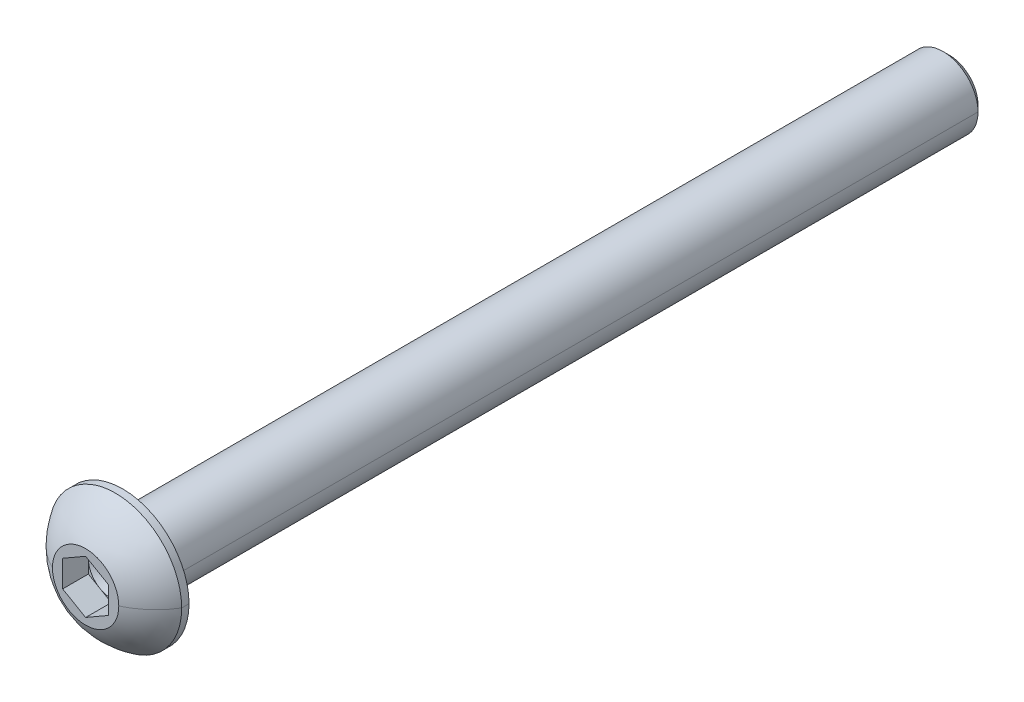
ISO-10303-21;
HEADER;
FILE_DESCRIPTION(('STEP AP214'),'2;1');
FILE_NAME('part.step','',(''),(''),'','','');
FILE_SCHEMA(('AUTOMOTIVE_DESIGN { 1 0 10303 214 1 1 1 1 }'));
ENDSEC;
DATA;
#1=APPLICATION_CONTEXT('core data for automotive mechanical design processes');
#2=APPLICATION_PROTOCOL_DEFINITION('international standard','automotive_design',2000,#1);
#3=PRODUCT_CONTEXT('',#1,'mechanical');
#4=PRODUCT('Part','Part','',(#3));
#5=PRODUCT_RELATED_PRODUCT_CATEGORY('part','',(#4));
#6=PRODUCT_DEFINITION_FORMATION('','',#4);
#7=PRODUCT_DEFINITION_CONTEXT('part definition',#1,'design');
#8=PRODUCT_DEFINITION('design','',#6,#7);
#9=PRODUCT_DEFINITION_SHAPE('','',#8);
#10=(LENGTH_UNIT() NAMED_UNIT(*) SI_UNIT(.MILLI.,.METRE.));
#11=(NAMED_UNIT(*) PLANE_ANGLE_UNIT() SI_UNIT($,.RADIAN.));
#12=(NAMED_UNIT(*) SI_UNIT($,.STERADIAN.) SOLID_ANGLE_UNIT());
#13=UNCERTAINTY_MEASURE_WITH_UNIT(LENGTH_MEASURE(1.E-05),#10,'distance_accuracy_value','');
#14=(GEOMETRIC_REPRESENTATION_CONTEXT(3) GLOBAL_UNCERTAINTY_ASSIGNED_CONTEXT((#13)) GLOBAL_UNIT_ASSIGNED_CONTEXT((#10,
#11,#12)) REPRESENTATION_CONTEXT('',''));
#15=CARTESIAN_POINT('',(0.,0.,0.));
#16=DIRECTION('',(0.,0.,1.));
#17=DIRECTION('',(1.,0.,0.));
#18=AXIS2_PLACEMENT_3D('',#15,#16,#17);
#19=CARTESIAN_POINT('',(0.,0.,-1.778));
#20=DIRECTION('',(0.,0.,1.));
#21=DIRECTION('',(1.,0.,0.));
#22=AXIS2_PLACEMENT_3D('',#19,#20,#21);
#23=PLANE('',#22);
#24=CARTESIAN_POINT('',(0.,0.,-1.778));
#25=DIRECTION('',(0.,0.,1.));
#26=DIRECTION('',(1.,0.,0.));
#27=AXIS2_PLACEMENT_3D('',#24,#25,#26);
#28=CIRCLE('',#27,1.5875);
#29=CARTESIAN_POINT('',(1.5875,0.,-1.778));
#30=VERTEX_POINT('',#29);
#31=CARTESIAN_POINT('',(0.79375,1.3748153285078,-1.778));
#32=VERTEX_POINT('',#31);
#33=EDGE_CURVE('E294',#30,#32,#28,.T.);
#34=ORIENTED_EDGE('',*,*,#33,.F.);
#35=DIRECTION('',(0.,-1.,0.));
#36=VECTOR('',#35,1.);
#37=CARTESIAN_POINT('',(1.5875,0.,-1.778));
#38=LINE('',#37,#36);
#39=CARTESIAN_POINT('',(1.5875,0.916543552338531,-1.778));
#40=VERTEX_POINT('',#39);
#41=EDGE_CURVE('E234',#40,#30,#38,.T.);
#42=ORIENTED_EDGE('',*,*,#41,.F.);
#43=DIRECTION('',(0.866025403784439,-0.5,0.));
#44=VECTOR('',#43,1.);
#45=CARTESIAN_POINT('',(0.79375,1.3748153285078,-1.778));
#46=LINE('',#45,#44);
#47=EDGE_CURVE('E376',#32,#40,#46,.T.);
#48=ORIENTED_EDGE('',*,*,#47,.F.);
#49=EDGE_LOOP('',(#34,#42,#48));
#50=FACE_BOUND('',#49,.T.);
#51=ADVANCED_FACE('F17',(#50),#23,.T.);
#52=CARTESIAN_POINT('',(0.,0.,-1.778));
#53=DIRECTION('',(0.,0.,1.));
#54=DIRECTION('',(1.,0.,0.));
#55=AXIS2_PLACEMENT_3D('',#52,#53,#54);
#56=PLANE('',#55);
#57=CARTESIAN_POINT('',(0.,0.,-1.778));
#58=DIRECTION('',(0.,0.,1.));
#59=DIRECTION('',(1.,0.,0.));
#60=AXIS2_PLACEMENT_3D('',#57,#58,#59);
#61=CIRCLE('',#60,1.5875);
#62=CARTESIAN_POINT('',(-0.79375,1.37481532850779,-1.778));
#63=VERTEX_POINT('',#62);
#64=EDGE_CURVE('E298',#32,#63,#61,.T.);
#65=ORIENTED_EDGE('',*,*,#64,.F.);
#66=DIRECTION('',(0.866025403784439,-0.5,0.));
#67=VECTOR('',#66,1.);
#68=CARTESIAN_POINT('',(0.79375,1.3748153285078,-1.778));
#69=LINE('',#68,#67);
#70=CARTESIAN_POINT('',(0.,1.83308710467706,-1.778));
#71=VERTEX_POINT('',#70);
#72=EDGE_CURVE('E40',#71,#32,#69,.T.);
#73=ORIENTED_EDGE('',*,*,#72,.F.);
#74=DIRECTION('',(0.866025403784438,0.5,0.));
#75=VECTOR('',#74,1.);
#76=CARTESIAN_POINT('',(-0.79375,1.37481532850779,-1.778));
#77=LINE('',#76,#75);
#78=EDGE_CURVE('E213',#63,#71,#77,.T.);
#79=ORIENTED_EDGE('',*,*,#78,.F.);
#80=EDGE_LOOP('',(#65,#73,#79));
#81=FACE_BOUND('',#80,.T.);
#82=ADVANCED_FACE('F428',(#81),#56,.T.);
#83=CARTESIAN_POINT('',(0.,0.,-1.778));
#84=DIRECTION('',(0.,0.,1.));
#85=DIRECTION('',(1.,0.,0.));
#86=AXIS2_PLACEMENT_3D('',#83,#84,#85);
#87=PLANE('',#86);
#88=CARTESIAN_POINT('',(0.,0.,-1.778));
#89=DIRECTION('',(0.,0.,1.));
#90=DIRECTION('',(1.,0.,0.));
#91=AXIS2_PLACEMENT_3D('',#88,#89,#90);
#92=CIRCLE('',#91,1.5875);
#93=CARTESIAN_POINT('',(-1.5875,0.,-1.778));
#94=VERTEX_POINT('',#93);
#95=EDGE_CURVE('E302',#63,#94,#92,.T.);
#96=ORIENTED_EDGE('',*,*,#95,.F.);
#97=DIRECTION('',(0.866025403784438,0.5,0.));
#98=VECTOR('',#97,1.);
#99=CARTESIAN_POINT('',(-0.79375,1.37481532850779,-1.778));
#100=LINE('',#99,#98);
#101=CARTESIAN_POINT('',(-1.5875,0.916543552338527,-1.778));
#102=VERTEX_POINT('',#101);
#103=EDGE_CURVE('E343',#102,#63,#100,.T.);
#104=ORIENTED_EDGE('',*,*,#103,.F.);
#105=DIRECTION('',(0.,1.,0.));
#106=VECTOR('',#105,1.);
#107=CARTESIAN_POINT('',(-1.5875,0.,-1.778));
#108=LINE('',#107,#106);
#109=EDGE_CURVE('E254',#94,#102,#108,.T.);
#110=ORIENTED_EDGE('',*,*,#109,.F.);
#111=EDGE_LOOP('',(#96,#104,#110));
#112=FACE_BOUND('',#111,.T.);
#113=ADVANCED_FACE('F434',(#112),#87,.T.);
#114=CARTESIAN_POINT('',(0.,0.,-1.778));
#115=DIRECTION('',(0.,0.,1.));
#116=DIRECTION('',(1.,0.,0.));
#117=AXIS2_PLACEMENT_3D('',#114,#115,#116);
#118=PLANE('',#117);
#119=CARTESIAN_POINT('',(0.,0.,-1.778));
#120=DIRECTION('',(0.,0.,1.));
#121=DIRECTION('',(1.,0.,0.));
#122=AXIS2_PLACEMENT_3D('',#119,#120,#121);
#123=CIRCLE('',#122,1.5875);
#124=CARTESIAN_POINT('',(-0.79375,-1.3748153285078,-1.778));
#125=VERTEX_POINT('',#124);
#126=EDGE_CURVE('E264',#94,#125,#123,.T.);
#127=ORIENTED_EDGE('',*,*,#126,.F.);
#128=DIRECTION('',(0.,1.,0.));
#129=VECTOR('',#128,1.);
#130=CARTESIAN_POINT('',(-1.5875,0.,-1.778));
#131=LINE('',#130,#129);
#132=CARTESIAN_POINT('',(-1.5875,-0.916543552338531,-1.778));
#133=VERTEX_POINT('',#132);
#134=EDGE_CURVE('E315',#133,#94,#131,.T.);
#135=ORIENTED_EDGE('',*,*,#134,.F.);
#136=DIRECTION('',(-0.866025403784439,0.5,0.));
#137=VECTOR('',#136,1.);
#138=CARTESIAN_POINT('',(-0.79375,-1.3748153285078,-1.778));
#139=LINE('',#138,#137);
#140=EDGE_CURVE('E355',#125,#133,#139,.T.);
#141=ORIENTED_EDGE('',*,*,#140,.F.);
#142=EDGE_LOOP('',(#127,#135,#141));
#143=FACE_BOUND('',#142,.T.);
#144=ADVANCED_FACE('F451',(#143),#118,.T.);
#145=CARTESIAN_POINT('',(0.,0.,-1.778));
#146=DIRECTION('',(0.,0.,1.));
#147=DIRECTION('',(1.,0.,0.));
#148=AXIS2_PLACEMENT_3D('',#145,#146,#147);
#149=PLANE('',#148);
#150=CARTESIAN_POINT('',(0.,0.,-1.778));
#151=DIRECTION('',(0.,0.,1.));
#152=DIRECTION('',(1.,0.,0.));
#153=AXIS2_PLACEMENT_3D('',#150,#151,#152);
#154=CIRCLE('',#153,1.5875);
#155=CARTESIAN_POINT('',(0.79375,-1.37481532850779,-1.778));
#156=VERTEX_POINT('',#155);
#157=EDGE_CURVE('E268',#125,#156,#154,.T.);
#158=ORIENTED_EDGE('',*,*,#157,.F.);
#159=DIRECTION('',(-0.866025403784439,0.5,0.));
#160=VECTOR('',#159,1.);
#161=CARTESIAN_POINT('',(-0.79375,-1.3748153285078,-1.778));
#162=LINE('',#161,#160);
#163=CARTESIAN_POINT('',(0.,-1.83308710467706,-1.778));
#164=VERTEX_POINT('',#163);
#165=EDGE_CURVE('E351',#164,#125,#162,.T.);
#166=ORIENTED_EDGE('',*,*,#165,.F.);
#167=DIRECTION('',(-0.866025403784438,-0.5,0.));
#168=VECTOR('',#167,1.);
#169=CARTESIAN_POINT('',(0.79375,-1.37481532850779,-1.778));
#170=LINE('',#169,#168);
#171=EDGE_CURVE('E332',#156,#164,#170,.T.);
#172=ORIENTED_EDGE('',*,*,#171,.F.);
#173=EDGE_LOOP('',(#158,#166,#172));
#174=FACE_BOUND('',#173,.T.);
#175=ADVANCED_FACE('F457',(#174),#149,.T.);
#176=CARTESIAN_POINT('',(-1.146175,0.,0.));
#177=DIRECTION('',(0.,0.,1.));
#178=DIRECTION('',(1.,0.,0.));
#179=AXIS2_PLACEMENT_3D('',#176,#177,#178);
#180=PLANE('',#179);
#181=DIRECTION('',(0.866025403784438,0.5,0.));
#182=VECTOR('',#181,1.);
#183=CARTESIAN_POINT('',(-0.79375,1.37481532850779,0.));
#184=LINE('',#183,#182);
#185=CARTESIAN_POINT('',(-1.5875,0.916543552338527,0.));
#186=VERTEX_POINT('',#185);
#187=CARTESIAN_POINT('',(0.,1.83308710467706,0.));
#188=VERTEX_POINT('',#187);
#189=EDGE_CURVE('E253',#186,#188,#184,.T.);
#190=ORIENTED_EDGE('',*,*,#189,.T.);
#191=DIRECTION('',(0.866025403784439,-0.5,0.));
#192=VECTOR('',#191,1.);
#193=CARTESIAN_POINT('',(0.79375,1.3748153285078,0.));
#194=LINE('',#193,#192);
#195=CARTESIAN_POINT('',(1.5875,0.916543552338531,0.));
#196=VERTEX_POINT('',#195);
#197=EDGE_CURVE('E50',#188,#196,#194,.T.);
#198=ORIENTED_EDGE('',*,*,#197,.T.);
#199=DIRECTION('',(0.,-1.,0.));
#200=VECTOR('',#199,1.);
#201=CARTESIAN_POINT('',(1.5875,0.,0.));
#202=LINE('',#201,#200);
#203=CARTESIAN_POINT('',(1.5875,-0.916543552338531,0.));
#204=VERTEX_POINT('',#203);
#205=EDGE_CURVE('E235',#196,#204,#202,.T.);
#206=ORIENTED_EDGE('',*,*,#205,.T.);
#207=DIRECTION('',(-0.866025403784438,-0.5,0.));
#208=VECTOR('',#207,1.);
#209=CARTESIAN_POINT('',(0.79375,-1.37481532850779,0.));
#210=LINE('',#209,#208);
#211=CARTESIAN_POINT('',(0.,-1.83308710467706,0.));
#212=VERTEX_POINT('',#211);
#213=EDGE_CURVE('E328',#204,#212,#210,.T.);
#214=ORIENTED_EDGE('',*,*,#213,.T.);
#215=DIRECTION('',(-0.866025403784439,0.5,0.));
#216=VECTOR('',#215,1.);
#217=CARTESIAN_POINT('',(-0.79375,-1.3748153285078,0.));
#218=LINE('',#217,#216);
#219=CARTESIAN_POINT('',(-1.5875,-0.916543552338531,0.));
#220=VERTEX_POINT('',#219);
#221=EDGE_CURVE('E347',#212,#220,#218,.T.);
#222=ORIENTED_EDGE('',*,*,#221,.T.);
#223=DIRECTION('',(0.,1.,0.));
#224=VECTOR('',#223,1.);
#225=CARTESIAN_POINT('',(-1.5875,0.,0.));
#226=LINE('',#225,#224);
#227=EDGE_CURVE('E311',#220,#186,#226,.T.);
#228=ORIENTED_EDGE('',*,*,#227,.T.);
#229=EDGE_LOOP('',(#190,#198,#206,#214,#222,#228));
#230=FACE_BOUND('',#229,.T.);
#231=CARTESIAN_POINT('',(0.,0.,0.));
#232=DIRECTION('',(0.,0.,-1.));
#233=DIRECTION('',(-1.,0.,0.));
#234=AXIS2_PLACEMENT_3D('',#231,#232,#233);
#235=CIRCLE('',#234,2.29235);
#236=CARTESIAN_POINT('',(-2.29235,0.,0.));
#237=VERTEX_POINT('',#236);
#238=CARTESIAN_POINT('',(2.29235,0.,0.));
#239=VERTEX_POINT('',#238);
#240=EDGE_CURVE('E244',#237,#239,#235,.T.);
#241=ORIENTED_EDGE('',*,*,#240,.F.);
#242=CARTESIAN_POINT('',(0.,0.,0.));
#243=DIRECTION('',(0.,0.,-1.));
#244=DIRECTION('',(-1.,0.,0.));
#245=AXIS2_PLACEMENT_3D('',#242,#243,#244);
#246=CIRCLE('',#245,2.29235);
#247=EDGE_CURVE('E378',#239,#237,#246,.T.);
#248=ORIENTED_EDGE('',*,*,#247,.F.);
#249=EDGE_LOOP('',(#241,#248));
#250=FACE_BOUND('',#249,.T.);
#251=ADVANCED_FACE('F425',(#230,#250),#180,.T.);
#252=CARTESIAN_POINT('',(0.,0.,1.48381805047393));
#253=DIRECTION('',(0.,0.,-1.));
#254=DIRECTION('',(-1.,0.,0.));
#255=AXIS2_PLACEMENT_3D('',#252,#253,#254);
#256=CYLINDRICAL_SURFACE('',#255,4.5847);
#257=DIRECTION('',(0.,0.,-1.));
#258=VECTOR('',#257,1.);
#259=CARTESIAN_POINT('',(4.5847,0.,1.48381805047393));
#260=LINE('',#259,#258);
#261=CARTESIAN_POINT('',(4.5847,0.,-2.0574));
#262=VERTEX_POINT('',#261);
#263=CARTESIAN_POINT('',(4.5847,0.,-2.5654));
#264=VERTEX_POINT('',#263);
#265=EDGE_CURVE('E208',#262,#264,#260,.T.);
#266=ORIENTED_EDGE('',*,*,#265,.F.);
#267=CARTESIAN_POINT('',(0.,0.,-2.0574));
#268=DIRECTION('',(0.,0.,-1.));
#269=DIRECTION('',(-1.,0.,0.));
#270=AXIS2_PLACEMENT_3D('',#267,#268,#269);
#271=CIRCLE('',#270,4.5847);
#272=CARTESIAN_POINT('',(-4.5847,0.,-2.0574));
#273=VERTEX_POINT('',#272);
#274=EDGE_CURVE('E20',#262,#273,#271,.T.);
#275=ORIENTED_EDGE('',*,*,#274,.T.);
#276=DIRECTION('',(0.,0.,-1.));
#277=VECTOR('',#276,1.);
#278=CARTESIAN_POINT('',(-4.5847,0.,1.48381805047393));
#279=LINE('',#278,#277);
#280=CARTESIAN_POINT('',(-4.5847,0.,-2.5654));
#281=VERTEX_POINT('',#280);
#282=EDGE_CURVE('E204',#273,#281,#279,.T.);
#283=ORIENTED_EDGE('',*,*,#282,.T.);
#284=CARTESIAN_POINT('',(0.,0.,-2.5654));
#285=DIRECTION('',(0.,0.,-1.));
#286=DIRECTION('',(-1.,0.,0.));
#287=AXIS2_PLACEMENT_3D('',#284,#285,#286);
#288=CIRCLE('',#287,4.5847);
#289=EDGE_CURVE('E11',#264,#281,#288,.T.);
#290=ORIENTED_EDGE('',*,*,#289,.F.);
#291=EDGE_LOOP('',(#266,#275,#283,#290));
#292=FACE_BOUND('',#291,.T.);
#293=ADVANCED_FACE('F390',(#292),#256,.T.);
#294=CARTESIAN_POINT('',(-3.68935,0.,-2.5654));
#295=DIRECTION('',(0.,0.,-1.));
#296=DIRECTION('',(0.,-1.,0.));
#297=AXIS2_PLACEMENT_3D('',#294,#295,#296);
#298=PLANE('',#297);
#299=CARTESIAN_POINT('',(0.,0.,-2.5654));
#300=DIRECTION('',(0.,0.,-1.));
#301=DIRECTION('',(-1.,0.,0.));
#302=AXIS2_PLACEMENT_3D('',#299,#300,#301);
#303=CIRCLE('',#302,2.794);
#304=CARTESIAN_POINT('',(-2.794,0.,-2.5654));
#305=VERTEX_POINT('',#304);
#306=CARTESIAN_POINT('',(2.794,0.,-2.5654));
#307=VERTEX_POINT('',#306);
#308=EDGE_CURVE('E26',#305,#307,#303,.T.);
#309=ORIENTED_EDGE('',*,*,#308,.F.);
#310=CARTESIAN_POINT('',(0.,0.,-2.5654));
#311=DIRECTION('',(0.,0.,-1.));
#312=DIRECTION('',(-1.,0.,0.));
#313=AXIS2_PLACEMENT_3D('',#310,#311,#312);
#314=CIRCLE('',#313,2.794);
#315=EDGE_CURVE('E189',#307,#305,#314,.T.);
#316=ORIENTED_EDGE('',*,*,#315,.F.);
#317=EDGE_LOOP('',(#309,#316));
#318=FACE_BOUND('',#317,.T.);
#319=CARTESIAN_POINT('',(0.,0.,-2.5654));
#320=DIRECTION('',(0.,0.,-1.));
#321=DIRECTION('',(-1.,0.,0.));
#322=AXIS2_PLACEMENT_3D('',#319,#320,#321);
#323=CIRCLE('',#322,4.5847);
#324=EDGE_CURVE('E217',#281,#264,#323,.T.);
#325=ORIENTED_EDGE('',*,*,#324,.T.);
#326=ORIENTED_EDGE('',*,*,#289,.T.);
#327=EDGE_LOOP('',(#325,#326));
#328=FACE_BOUND('',#327,.T.);
#329=ADVANCED_FACE('F190',(#318,#328),#298,.T.);
#330=CARTESIAN_POINT('',(0.,0.,-2.9464));
#331=DIRECTION('',(0.,0.,-1.));
#332=DIRECTION('',(-1.,0.,0.));
#333=AXIS2_PLACEMENT_3D('',#330,#331,#332);
#334=TOROIDAL_SURFACE('',#333,2.794,0.381);
#335=CARTESIAN_POINT('',(2.794,0.,-2.9464));
#336=DIRECTION('',(0.,1.,0.));
#337=DIRECTION('',(-1.,0.,0.));
#338=AXIS2_PLACEMENT_3D('',#335,#336,#337);
#339=CIRCLE('',#338,0.381);
#340=CARTESIAN_POINT('',(2.413,0.,-2.9464));
#341=VERTEX_POINT('',#340);
#342=EDGE_CURVE('E181',#341,#307,#339,.T.);
#343=ORIENTED_EDGE('',*,*,#342,.F.);
#344=CARTESIAN_POINT('',(0.,0.,-2.9464));
#345=DIRECTION('',(0.,0.,-1.));
#346=DIRECTION('',(-1.,0.,0.));
#347=AXIS2_PLACEMENT_3D('',#344,#345,#346);
#348=CIRCLE('',#347,2.413);
#349=CARTESIAN_POINT('',(-2.413,0.,-2.9464));
#350=VERTEX_POINT('',#349);
#351=EDGE_CURVE('E224',#350,#341,#348,.T.);
#352=ORIENTED_EDGE('',*,*,#351,.F.);
#353=CARTESIAN_POINT('',(-2.794,0.,-2.9464));
#354=DIRECTION('',(0.,-1.,0.));
#355=DIRECTION('',(0.,0.,-1.));
#356=AXIS2_PLACEMENT_3D('',#353,#354,#355);
#357=CIRCLE('',#356,0.381);
#358=EDGE_CURVE('E184',#350,#305,#357,.T.);
#359=ORIENTED_EDGE('',*,*,#358,.T.);
#360=ORIENTED_EDGE('',*,*,#308,.T.);
#361=EDGE_LOOP('',(#343,#352,#359,#360));
#362=FACE_BOUND('',#361,.T.);
#363=ADVANCED_FACE('F178',(#362),#334,.F.);
#364=CARTESIAN_POINT('',(0.,0.,1.48381805047393));
#365=DIRECTION('',(0.,0.,-1.));
#366=DIRECTION('',(-1.,0.,0.));
#367=AXIS2_PLACEMENT_3D('',#364,#365,#366);
#368=CYLINDRICAL_SURFACE('',#367,2.413);
#369=DIRECTION('',(0.,0.,-1.));
#370=VECTOR('',#369,1.);
#371=CARTESIAN_POINT('',(2.413,0.,1.48381805047393));
#372=LINE('',#371,#370);
#373=CARTESIAN_POINT('',(2.413,0.,-59.28645761938));
#374=VERTEX_POINT('',#373);
#375=EDGE_CURVE('E227',#341,#374,#372,.T.);
#376=ORIENTED_EDGE('',*,*,#375,.F.);
#377=CARTESIAN_POINT('',(0.,0.,-2.9464));
#378=DIRECTION('',(0.,0.,-1.));
#379=DIRECTION('',(-1.,0.,0.));
#380=AXIS2_PLACEMENT_3D('',#377,#378,#379);
#381=CIRCLE('',#380,2.413);
#382=EDGE_CURVE('E197',#341,#350,#381,.T.);
#383=ORIENTED_EDGE('',*,*,#382,.T.);
#384=DIRECTION('',(0.,0.,-1.));
#385=VECTOR('',#384,1.);
#386=CARTESIAN_POINT('',(-2.413,0.,1.48381805047393));
#387=LINE('',#386,#385);
#388=CARTESIAN_POINT('',(-2.413,0.,-59.28645761938));
#389=VERTEX_POINT('',#388);
#390=EDGE_CURVE('E240',#350,#389,#387,.T.);
#391=ORIENTED_EDGE('',*,*,#390,.T.);
#392=CARTESIAN_POINT('',(0.,0.,-59.28645761938));
#393=DIRECTION('',(0.,0.,1.));
#394=DIRECTION('',(-1.,0.,0.));
#395=AXIS2_PLACEMENT_3D('',#392,#393,#394);
#396=CIRCLE('',#395,2.413);
#397=EDGE_CURVE('E291',#389,#374,#396,.T.);
#398=ORIENTED_EDGE('',*,*,#397,.T.);
#399=EDGE_LOOP('',(#376,#383,#391,#398));
#400=FACE_BOUND('',#399,.T.);
#401=ADVANCED_FACE('F423',(#400),#368,.T.);
#402=CARTESIAN_POINT('',(-1.2065,0.,-59.7154));
#403=DIRECTION('',(0.,0.,-1.));
#404=DIRECTION('',(0.,-1.,0.));
#405=AXIS2_PLACEMENT_3D('',#402,#403,#404);
#406=PLANE('',#405);
#407=CARTESIAN_POINT('',(0.,0.,-59.7154));
#408=DIRECTION('',(0.,0.,-1.));
#409=DIRECTION('',(-1.,0.,0.));
#410=AXIS2_PLACEMENT_3D('',#407,#408,#409);
#411=CIRCLE('',#410,1.98405761938);
#412=CARTESIAN_POINT('',(1.98405761938,0.,-59.7154));
#413=VERTEX_POINT('',#412);
#414=CARTESIAN_POINT('',(-1.98405761938,0.,-59.7154));
#415=VERTEX_POINT('',#414);
#416=EDGE_CURVE('E288',#413,#415,#411,.T.);
#417=ORIENTED_EDGE('',*,*,#416,.T.);
#418=CARTESIAN_POINT('',(0.,0.,-59.7154));
#419=DIRECTION('',(0.,0.,-1.));
#420=DIRECTION('',(-1.,0.,0.));
#421=AXIS2_PLACEMENT_3D('',#418,#419,#420);
#422=CIRCLE('',#421,1.98405761938);
#423=EDGE_CURVE('E276',#415,#413,#422,.T.);
#424=ORIENTED_EDGE('',*,*,#423,.T.);
#425=EDGE_LOOP('',(#417,#424));
#426=FACE_BOUND('',#425,.T.);
#427=ADVANCED_FACE('F492',(#426),#406,.T.);
#428=CARTESIAN_POINT('',(0.,0.,-4.85989606481481));
#429=DIRECTION('',(0.,1.,0.));
#430=DIRECTION('',(-1.,0.,0.));
#431=AXIS2_PLACEMENT_3D('',#428,#429,#430);
#432=SPHERICAL_SURFACE('',#431,5.37340285883187);
#433=CARTESIAN_POINT('',(0.,0.,-4.85989606481481));
#434=DIRECTION('',(0.,1.,0.));
#435=DIRECTION('',(-1.,0.,0.));
#436=AXIS2_PLACEMENT_3D('',#433,#434,#435);
#437=CIRCLE('',#436,5.37340285883187);
#438=EDGE_CURVE('E248',#239,#262,#437,.T.);
#439=ORIENTED_EDGE('',*,*,#438,.F.);
#440=ORIENTED_EDGE('',*,*,#247,.T.);
#441=CARTESIAN_POINT('',(0.,0.,-4.85989606481481));
#442=DIRECTION('',(0.,-1.,0.));
#443=DIRECTION('',(0.,0.,-1.));
#444=AXIS2_PLACEMENT_3D('',#441,#442,#443);
#445=CIRCLE('',#444,5.37340285883187);
#446=EDGE_CURVE('E223',#237,#273,#445,.T.);
#447=ORIENTED_EDGE('',*,*,#446,.T.);
#448=ORIENTED_EDGE('',*,*,#274,.F.);
#449=EDGE_LOOP('',(#439,#440,#447,#448));
#450=FACE_BOUND('',#449,.T.);
#451=ADVANCED_FACE('F395',(#450),#432,.T.);
#452=CARTESIAN_POINT('',(0.79375,1.3748153285078,-1.778));
#453=DIRECTION('',(-0.5,-0.866025403784439,0.));
#454=DIRECTION('',(-0.866025403784439,0.5,0.));
#455=AXIS2_PLACEMENT_3D('',#452,#453,#454);
#456=PLANE('',#455);
#457=ORIENTED_EDGE('',*,*,#197,.F.);
#458=DIRECTION('',(0.,0.,1.));
#459=VECTOR('',#458,1.);
#460=CARTESIAN_POINT('',(0.,1.83308710467706,-1.778));
#461=LINE('',#460,#459);
#462=EDGE_CURVE('E210',#71,#188,#461,.T.);
#463=ORIENTED_EDGE('',*,*,#462,.F.);
#464=ORIENTED_EDGE('',*,*,#72,.T.);
#465=ORIENTED_EDGE('',*,*,#47,.T.);
#466=DIRECTION('',(0.,0.,1.));
#467=VECTOR('',#466,1.);
#468=CARTESIAN_POINT('',(1.5875,0.916543552338531,-1.778));
#469=LINE('',#468,#467);
#470=EDGE_CURVE('E231',#40,#196,#469,.T.);
#471=ORIENTED_EDGE('',*,*,#470,.T.);
#472=EDGE_LOOP('',(#457,#463,#464,#465,#471));
#473=FACE_BOUND('',#472,.T.);
#474=ADVANCED_FACE('F464',(#473),#456,.T.);
#475=CARTESIAN_POINT('',(-0.79375,1.37481532850779,-1.778));
#476=DIRECTION('',(0.5,-0.866025403784439,0.));
#477=DIRECTION('',(0.,0.,-1.));
#478=AXIS2_PLACEMENT_3D('',#475,#476,#477);
#479=PLANE('',#478);
#480=ORIENTED_EDGE('',*,*,#189,.F.);
#481=DIRECTION('',(0.,0.,1.));
#482=VECTOR('',#481,1.);
#483=CARTESIAN_POINT('',(-1.5875,0.916543552338527,-1.778));
#484=LINE('',#483,#482);
#485=EDGE_CURVE('E249',#102,#186,#484,.T.);
#486=ORIENTED_EDGE('',*,*,#485,.F.);
#487=ORIENTED_EDGE('',*,*,#103,.T.);
#488=ORIENTED_EDGE('',*,*,#78,.T.);
#489=ORIENTED_EDGE('',*,*,#462,.T.);
#490=EDGE_LOOP('',(#480,#486,#487,#488,#489));
#491=FACE_BOUND('',#490,.T.);
#492=ADVANCED_FACE('F467',(#491),#479,.T.);
#493=CARTESIAN_POINT('',(-1.5875,0.,-1.778));
#494=DIRECTION('',(1.,0.,0.));
#495=DIRECTION('',(0.,1.,0.));
#496=AXIS2_PLACEMENT_3D('',#493,#494,#495);
#497=PLANE('',#496);
#498=ORIENTED_EDGE('',*,*,#227,.F.);
#499=DIRECTION('',(0.,0.,1.));
#500=VECTOR('',#499,1.);
#501=CARTESIAN_POINT('',(-1.5875,-0.916543552338531,-1.778));
#502=LINE('',#501,#500);
#503=EDGE_CURVE('E316',#133,#220,#502,.T.);
#504=ORIENTED_EDGE('',*,*,#503,.F.);
#505=ORIENTED_EDGE('',*,*,#134,.T.);
#506=ORIENTED_EDGE('',*,*,#109,.T.);
#507=ORIENTED_EDGE('',*,*,#485,.T.);
#508=EDGE_LOOP('',(#498,#504,#505,#506,#507));
#509=FACE_BOUND('',#508,.T.);
#510=ADVANCED_FACE('F470',(#509),#497,.T.);
#511=CARTESIAN_POINT('',(-0.79375,-1.3748153285078,-1.778));
#512=DIRECTION('',(0.5,0.866025403784439,0.));
#513=DIRECTION('',(0.,0.,-1.));
#514=AXIS2_PLACEMENT_3D('',#511,#512,#513);
#515=PLANE('',#514);
#516=ORIENTED_EDGE('',*,*,#221,.F.);
#517=DIRECTION('',(0.,0.,1.));
#518=VECTOR('',#517,1.);
#519=CARTESIAN_POINT('',(0.,-1.83308710467706,-1.778));
#520=LINE('',#519,#518);
#521=EDGE_CURVE('E339',#164,#212,#520,.T.);
#522=ORIENTED_EDGE('',*,*,#521,.F.);
#523=ORIENTED_EDGE('',*,*,#165,.T.);
#524=ORIENTED_EDGE('',*,*,#140,.T.);
#525=ORIENTED_EDGE('',*,*,#503,.T.);
#526=EDGE_LOOP('',(#516,#522,#523,#524,#525));
#527=FACE_BOUND('',#526,.T.);
#528=ADVANCED_FACE('F455',(#527),#515,.T.);
#529=CARTESIAN_POINT('',(0.79375,-1.37481532850779,-1.778));
#530=DIRECTION('',(-0.5,0.866025403784439,0.));
#531=DIRECTION('',(0.,0.,1.));
#532=AXIS2_PLACEMENT_3D('',#529,#530,#531);
#533=PLANE('',#532);
#534=ORIENTED_EDGE('',*,*,#213,.F.);
#535=DIRECTION('',(0.,0.,1.));
#536=VECTOR('',#535,1.);
#537=CARTESIAN_POINT('',(1.5875,-0.916543552338531,-1.778));
#538=LINE('',#537,#536);
#539=CARTESIAN_POINT('',(1.5875,-0.916543552338531,-1.778));
#540=VERTEX_POINT('',#539);
#541=EDGE_CURVE('E327',#540,#204,#538,.T.);
#542=ORIENTED_EDGE('',*,*,#541,.F.);
#543=DIRECTION('',(-0.866025403784438,-0.5,0.));
#544=VECTOR('',#543,1.);
#545=CARTESIAN_POINT('',(0.79375,-1.37481532850779,-1.778));
#546=LINE('',#545,#544);
#547=EDGE_CURVE('E306',#540,#156,#546,.T.);
#548=ORIENTED_EDGE('',*,*,#547,.T.);
#549=ORIENTED_EDGE('',*,*,#171,.T.);
#550=ORIENTED_EDGE('',*,*,#521,.T.);
#551=EDGE_LOOP('',(#534,#542,#548,#549,#550));
#552=FACE_BOUND('',#551,.T.);
#553=ADVANCED_FACE('F459',(#552),#533,.T.);
#554=CARTESIAN_POINT('',(1.5875,0.,-1.778));
#555=DIRECTION('',(-1.,0.,0.));
#556=DIRECTION('',(0.,0.,1.));
#557=AXIS2_PLACEMENT_3D('',#554,#555,#556);
#558=PLANE('',#557);
#559=ORIENTED_EDGE('',*,*,#205,.F.);
#560=ORIENTED_EDGE('',*,*,#470,.F.);
#561=ORIENTED_EDGE('',*,*,#41,.T.);
#562=DIRECTION('',(0.,-1.,0.));
#563=VECTOR('',#562,1.);
#564=CARTESIAN_POINT('',(1.5875,0.,-1.778));
#565=LINE('',#564,#563);
#566=EDGE_CURVE('E310',#30,#540,#565,.T.);
#567=ORIENTED_EDGE('',*,*,#566,.T.);
#568=ORIENTED_EDGE('',*,*,#541,.T.);
#569=EDGE_LOOP('',(#559,#560,#561,#567,#568));
#570=FACE_BOUND('',#569,.T.);
#571=ADVANCED_FACE('F463',(#570),#558,.T.);
#572=CARTESIAN_POINT('',(0.,0.,-1.778));
#573=DIRECTION('',(0.,0.,1.));
#574=DIRECTION('',(1.,0.,0.));
#575=AXIS2_PLACEMENT_3D('',#572,#573,#574);
#576=PLANE('',#575);
#577=CARTESIAN_POINT('',(0.,0.,-1.778));
#578=DIRECTION('',(0.,0.,1.));
#579=DIRECTION('',(1.,0.,0.));
#580=AXIS2_PLACEMENT_3D('',#577,#578,#579);
#581=CIRCLE('',#580,1.5875);
#582=EDGE_CURVE('E272',#156,#30,#581,.T.);
#583=ORIENTED_EDGE('',*,*,#582,.F.);
#584=ORIENTED_EDGE('',*,*,#547,.F.);
#585=ORIENTED_EDGE('',*,*,#566,.F.);
#586=EDGE_LOOP('',(#583,#584,#585));
#587=FACE_BOUND('',#586,.T.);
#588=ADVANCED_FACE('F460',(#587),#576,.T.);
#589=CARTESIAN_POINT('',(0.,0.,-1.778));
#590=DIRECTION('',(0.,0.,1.));
#591=DIRECTION('',(1.,0.,0.));
#592=AXIS2_PLACEMENT_3D('',#589,#590,#591);
#593=CONICAL_SURFACE('',#592,1.5875,1.0471975511966);
#594=DIRECTION('',(-0.866025403784439,0.,0.5));
#595=VECTOR('',#594,1.);
#596=CARTESIAN_POINT('',(-1.5875,0.,-1.778));
#597=LINE('',#596,#595);
#598=CARTESIAN_POINT('',(0.,0.,-2.69454355233854));
#599=VERTEX_POINT('',#598);
#600=EDGE_CURVE('E222',#599,#94,#597,.T.);
#601=ORIENTED_EDGE('',*,*,#600,.F.);
#602=DIRECTION('',(0.866025403784439,0.,0.5));
#603=VECTOR('',#602,1.);
#604=CARTESIAN_POINT('',(1.5875,0.,-1.778));
#605=LINE('',#604,#603);
#606=EDGE_CURVE('E218',#599,#30,#605,.T.);
#607=ORIENTED_EDGE('',*,*,#606,.T.);
#608=ORIENTED_EDGE('',*,*,#33,.T.);
#609=ORIENTED_EDGE('',*,*,#64,.T.);
#610=ORIENTED_EDGE('',*,*,#95,.T.);
#611=EDGE_LOOP('',(#601,#607,#608,#609,#610));
#612=FACE_BOUND('',#611,.T.);
#613=ADVANCED_FACE('F447',(#612),#593,.F.);
#614=CARTESIAN_POINT('',(0.,0.,-59.7154));
#615=DIRECTION('',(0.,0.,1.));
#616=DIRECTION('',(1.,0.,0.));
#617=AXIS2_PLACEMENT_3D('',#614,#615,#616);
#618=CONICAL_SURFACE('',#617,1.98405761938,0.785398163397445);
#619=DIRECTION('',(-0.707106781186545,0.,0.70710678118655));
#620=VECTOR('',#619,1.);
#621=CARTESIAN_POINT('',(-1.98405761938,0.,-59.7154));
#622=LINE('',#621,#620);
#623=EDGE_CURVE('E280',#415,#389,#622,.T.);
#624=ORIENTED_EDGE('',*,*,#623,.F.);
#625=ORIENTED_EDGE('',*,*,#416,.F.);
#626=DIRECTION('',(0.707106781186545,0.,0.70710678118655));
#627=VECTOR('',#626,1.);
#628=CARTESIAN_POINT('',(1.98405761938,0.,-59.7154));
#629=LINE('',#628,#627);
#630=EDGE_CURVE('E284',#413,#374,#629,.T.);
#631=ORIENTED_EDGE('',*,*,#630,.T.);
#632=ORIENTED_EDGE('',*,*,#397,.F.);
#633=EDGE_LOOP('',(#624,#625,#631,#632));
#634=FACE_BOUND('',#633,.T.);
#635=ADVANCED_FACE('F485',(#634),#618,.T.);
#636=CARTESIAN_POINT('',(0.,0.,-59.7154));
#637=DIRECTION('',(0.,0.,1.));
#638=DIRECTION('',(1.,0.,0.));
#639=AXIS2_PLACEMENT_3D('',#636,#637,#638);
#640=CONICAL_SURFACE('',#639,1.98405761938,0.785398163397445);
#641=ORIENTED_EDGE('',*,*,#423,.F.);
#642=ORIENTED_EDGE('',*,*,#623,.T.);
#643=CARTESIAN_POINT('',(0.,0.,-59.28645761938));
#644=DIRECTION('',(0.,0.,1.));
#645=DIRECTION('',(-1.,0.,0.));
#646=AXIS2_PLACEMENT_3D('',#643,#644,#645);
#647=CIRCLE('',#646,2.413);
#648=EDGE_CURVE('E236',#374,#389,#647,.T.);
#649=ORIENTED_EDGE('',*,*,#648,.F.);
#650=ORIENTED_EDGE('',*,*,#630,.F.);
#651=EDGE_LOOP('',(#641,#642,#649,#650));
#652=FACE_BOUND('',#651,.T.);
#653=ADVANCED_FACE('F507',(#652),#640,.T.);
#654=CARTESIAN_POINT('',(0.,0.,-1.778));
#655=DIRECTION('',(0.,0.,1.));
#656=DIRECTION('',(1.,0.,0.));
#657=AXIS2_PLACEMENT_3D('',#654,#655,#656);
#658=CONICAL_SURFACE('',#657,1.5875,1.0471975511966);
#659=ORIENTED_EDGE('',*,*,#606,.F.);
#660=ORIENTED_EDGE('',*,*,#600,.T.);
#661=ORIENTED_EDGE('',*,*,#126,.T.);
#662=ORIENTED_EDGE('',*,*,#157,.T.);
#663=ORIENTED_EDGE('',*,*,#582,.T.);
#664=EDGE_LOOP('',(#659,#660,#661,#662,#663));
#665=FACE_BOUND('',#664,.T.);
#666=ADVANCED_FACE('F442',(#665),#658,.F.);
#667=CARTESIAN_POINT('',(0.,0.,-4.85989606481481));
#668=DIRECTION('',(0.,1.,0.));
#669=DIRECTION('',(-1.,0.,0.));
#670=AXIS2_PLACEMENT_3D('',#667,#668,#669);
#671=SPHERICAL_SURFACE('',#670,5.37340285883187);
#672=ORIENTED_EDGE('',*,*,#240,.T.);
#673=ORIENTED_EDGE('',*,*,#438,.T.);
#674=CARTESIAN_POINT('',(0.,0.,-2.0574));
#675=DIRECTION('',(0.,0.,-1.));
#676=DIRECTION('',(-1.,0.,0.));
#677=AXIS2_PLACEMENT_3D('',#674,#675,#676);
#678=CIRCLE('',#677,4.5847);
#679=EDGE_CURVE('E401',#273,#262,#678,.T.);
#680=ORIENTED_EDGE('',*,*,#679,.F.);
#681=ORIENTED_EDGE('',*,*,#446,.F.);
#682=EDGE_LOOP('',(#672,#673,#680,#681));
#683=FACE_BOUND('',#682,.T.);
#684=ADVANCED_FACE('F403',(#683),#671,.T.);
#685=CARTESIAN_POINT('',(0.,0.,1.48381805047393));
#686=DIRECTION('',(0.,0.,-1.));
#687=DIRECTION('',(-1.,0.,0.));
#688=AXIS2_PLACEMENT_3D('',#685,#686,#687);
#689=CYLINDRICAL_SURFACE('',#688,2.413);
#690=ORIENTED_EDGE('',*,*,#351,.T.);
#691=ORIENTED_EDGE('',*,*,#375,.T.);
#692=ORIENTED_EDGE('',*,*,#648,.T.);
#693=ORIENTED_EDGE('',*,*,#390,.F.);
#694=EDGE_LOOP('',(#690,#691,#692,#693));
#695=FACE_BOUND('',#694,.T.);
#696=ADVANCED_FACE('F502',(#695),#689,.T.);
#697=CARTESIAN_POINT('',(0.,0.,-2.9464));
#698=DIRECTION('',(0.,0.,-1.));
#699=DIRECTION('',(-1.,0.,0.));
#700=AXIS2_PLACEMENT_3D('',#697,#698,#699);
#701=TOROIDAL_SURFACE('',#700,2.794,0.381);
#702=ORIENTED_EDGE('',*,*,#382,.F.);
#703=ORIENTED_EDGE('',*,*,#342,.T.);
#704=ORIENTED_EDGE('',*,*,#315,.T.);
#705=ORIENTED_EDGE('',*,*,#358,.F.);
#706=EDGE_LOOP('',(#702,#703,#704,#705));
#707=FACE_BOUND('',#706,.T.);
#708=ADVANCED_FACE('F195',(#707),#701,.F.);
#709=CARTESIAN_POINT('',(0.,0.,1.48381805047393));
#710=DIRECTION('',(0.,0.,-1.));
#711=DIRECTION('',(-1.,0.,0.));
#712=AXIS2_PLACEMENT_3D('',#709,#710,#711);
#713=CYLINDRICAL_SURFACE('',#712,4.5847);
#714=ORIENTED_EDGE('',*,*,#679,.T.);
#715=ORIENTED_EDGE('',*,*,#265,.T.);
#716=ORIENTED_EDGE('',*,*,#324,.F.);
#717=ORIENTED_EDGE('',*,*,#282,.F.);
#718=EDGE_LOOP('',(#714,#715,#716,#717));
#719=FACE_BOUND('',#718,.T.);
#720=ADVANCED_FACE('F400',(#719),#713,.T.);
#721=CLOSED_SHELL('',(#51,#82,#113,#144,#175,#251,#293,#329,#363,#401,#427,#451,#474,#492,#510,
#528,#553,#571,#588,#613,#635,#653,#666,#684,#696,#708,#720));
#722=MANIFOLD_SOLID_BREP('B1',#721);
#723=ADVANCED_BREP_SHAPE_REPRESENTATION('',(#18,#722),#14);
#724=SHAPE_DEFINITION_REPRESENTATION(#9,#723);
ENDSEC;
END-ISO-10303-21;
